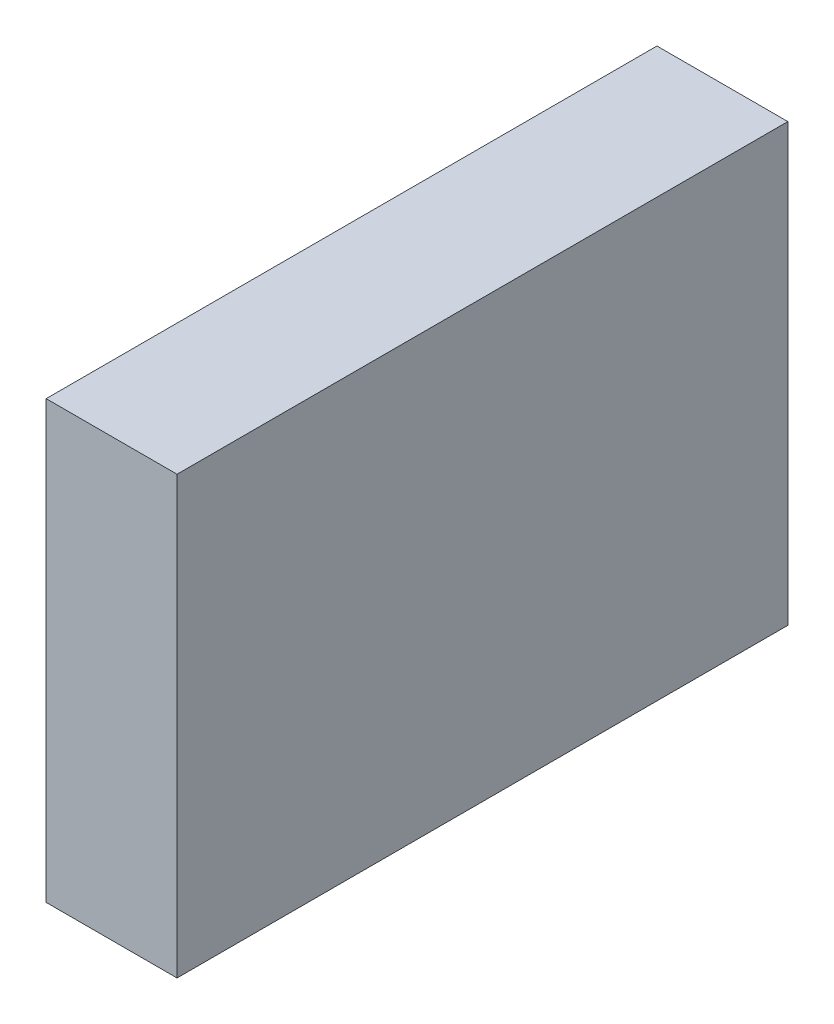
ISO-10303-21;
HEADER;
FILE_DESCRIPTION(('STEP AP214'),'2;1');
FILE_NAME('part.step','',(''),(''),'','','');
FILE_SCHEMA(('AUTOMOTIVE_DESIGN { 1 0 10303 214 1 1 1 1 }'));
ENDSEC;
DATA;
#1=APPLICATION_CONTEXT('core data for automotive mechanical design processes');
#2=APPLICATION_PROTOCOL_DEFINITION('international standard','automotive_design',2000,#1);
#3=PRODUCT_CONTEXT('',#1,'mechanical');
#4=PRODUCT('Part','Part','',(#3));
#5=PRODUCT_RELATED_PRODUCT_CATEGORY('part','',(#4));
#6=PRODUCT_DEFINITION_FORMATION('','',#4);
#7=PRODUCT_DEFINITION_CONTEXT('part definition',#1,'design');
#8=PRODUCT_DEFINITION('design','',#6,#7);
#9=PRODUCT_DEFINITION_SHAPE('','',#8);
#10=(LENGTH_UNIT() NAMED_UNIT(*) SI_UNIT(.MILLI.,.METRE.));
#11=(NAMED_UNIT(*) PLANE_ANGLE_UNIT() SI_UNIT($,.RADIAN.));
#12=(NAMED_UNIT(*) SI_UNIT($,.STERADIAN.) SOLID_ANGLE_UNIT());
#13=UNCERTAINTY_MEASURE_WITH_UNIT(LENGTH_MEASURE(1.E-05),#10,'distance_accuracy_value','');
#14=(GEOMETRIC_REPRESENTATION_CONTEXT(3) GLOBAL_UNCERTAINTY_ASSIGNED_CONTEXT((#13)) GLOBAL_UNIT_ASSIGNED_CONTEXT((#10,
#11,#12)) REPRESENTATION_CONTEXT('',''));
#15=CARTESIAN_POINT('',(0.,0.,0.));
#16=DIRECTION('',(0.,0.,1.));
#17=DIRECTION('',(1.,0.,0.));
#18=AXIS2_PLACEMENT_3D('',#15,#16,#17);
#19=CARTESIAN_POINT('',(3.90000011889499,0.679999495569579,-3.72112158044355));
#20=DIRECTION('',(1.,-1.74845553146952E-07,0.));
#21=DIRECTION('',(1.74845553146952E-07,1.,-8.74227765734759E-08));
#22=AXIS2_PLACEMENT_3D('',#19,#20,#21);
#23=PLANE('',#22);
#24=DIRECTION('',(0.,8.74227766369169E-08,0.999999999999996));
#25=VECTOR('',#24,1.);
#26=CARTESIAN_POINT('',(3.90000030597973,1.74999950169017,-3.65112167398592));
#27=LINE('',#26,#25);
#28=CARTESIAN_POINT('',(3.90000030597973,1.74999950169017,-3.65112167398492));
#29=VERTEX_POINT('',#28);
#30=CARTESIAN_POINT('',(3.90000030597974,1.74999962408106,-2.25112167398592));
#31=VERTEX_POINT('',#30);
#32=EDGE_CURVE('E11',#29,#31,#27,.T.);
#33=ORIENTED_EDGE('',*,*,#32,.F.);
#34=DIRECTION('',(1.74845553146599E-07,0.999999999999981,-8.74227765732994E-08));
#35=VECTOR('',#34,1.);
#36=CARTESIAN_POINT('',(3.90000013113418,0.749999501688174,-3.65112158656315));
#37=LINE('',#36,#35);
#38=CARTESIAN_POINT('',(3.90000013113418,0.749999501689174,-3.65112158656315));
#39=VERTEX_POINT('',#38);
#40=EDGE_CURVE('E59',#39,#29,#37,.T.);
#41=ORIENTED_EDGE('',*,*,#40,.F.);
#42=DIRECTION('',(0.,-8.74227765576152E-08,-0.999999999999996));
#43=VECTOR('',#42,1.);
#44=CARTESIAN_POINT('',(3.90000013113419,0.749999624080061,-2.25112158656315));
#45=LINE('',#44,#43);
#46=CARTESIAN_POINT('',(3.90000013113419,0.749999624080061,-2.25112158656415));
#47=VERTEX_POINT('',#46);
#48=EDGE_CURVE('E79',#47,#39,#45,.T.);
#49=ORIENTED_EDGE('',*,*,#48,.F.);
#50=DIRECTION('',(-1.74845553146599E-07,-0.999999999999981,8.74227765732993E-08));
#51=VECTOR('',#50,1.);
#52=CARTESIAN_POINT('',(3.90000030597974,1.74999962408206,-2.25112167398592));
#53=LINE('',#52,#51);
#54=EDGE_CURVE('E84',#31,#47,#53,.T.);
#55=ORIENTED_EDGE('',*,*,#54,.F.);
#56=EDGE_LOOP('',(#33,#41,#49,#55));
#57=FACE_BOUND('',#56,.T.);
#58=ADVANCED_FACE('F17',(#57),#23,.F.);
#59=CARTESIAN_POINT('',(4.20000011889499,0.679999443115913,-3.72112158044355));
#60=DIRECTION('',(1.,-1.74845553146952E-07,0.));
#61=DIRECTION('',(1.74845553146952E-07,1.,-8.74227765734759E-08));
#62=AXIS2_PLACEMENT_3D('',#59,#60,#61);
#63=PLANE('',#62);
#64=DIRECTION('',(-1.74845553146599E-07,-0.999999999999981,8.74227761292101E-08));
#65=VECTOR('',#64,1.);
#66=CARTESIAN_POINT('',(4.20000030597974,1.7499995716284,-2.25112167398592));
#67=LINE('',#66,#65);
#68=CARTESIAN_POINT('',(4.20000030597974,1.74999957162739,-2.25112167398592));
#69=VERTEX_POINT('',#68);
#70=CARTESIAN_POINT('',(4.20000013113419,0.749999571626395,-2.25112158656414));
#71=VERTEX_POINT('',#70);
#72=EDGE_CURVE('E24',#69,#71,#67,.T.);
#73=ORIENTED_EDGE('',*,*,#72,.T.);
#74=DIRECTION('',(0.,-8.74227765576152E-08,-0.999999999999996));
#75=VECTOR('',#74,1.);
#76=CARTESIAN_POINT('',(4.20000013113419,0.749999571626395,-2.25112158656314));
#77=LINE('',#76,#75);
#78=CARTESIAN_POINT('',(4.20000013113418,0.749999449235508,-3.65112158656314));
#79=VERTEX_POINT('',#78);
#80=EDGE_CURVE('E82',#71,#79,#77,.T.);
#81=ORIENTED_EDGE('',*,*,#80,.T.);
#82=DIRECTION('',(1.74845553146599E-07,0.999999999999981,-8.74227765732994E-08));
#83=VECTOR('',#82,1.);
#84=CARTESIAN_POINT('',(4.20000013113418,0.749999449234508,-3.65112158656314));
#85=LINE('',#84,#83);
#86=CARTESIAN_POINT('',(4.20000030597973,1.74999944923651,-3.65112167398492));
#87=VERTEX_POINT('',#86);
#88=EDGE_CURVE('E64',#79,#87,#85,.T.);
#89=ORIENTED_EDGE('',*,*,#88,.T.);
#90=DIRECTION('',(0.,8.74227764783136E-08,0.999999999999996));
#91=VECTOR('',#90,1.);
#92=CARTESIAN_POINT('',(4.20000030597973,1.74999944923651,-3.65112167398592));
#93=LINE('',#92,#91);
#94=EDGE_CURVE('E61',#87,#69,#93,.T.);
#95=ORIENTED_EDGE('',*,*,#94,.T.);
#96=EDGE_LOOP('',(#73,#81,#89,#95));
#97=FACE_BOUND('',#96,.T.);
#98=ADVANCED_FACE('F62',(#97),#63,.T.);
#99=CARTESIAN_POINT('',(3.90000030597974,1.74999962408206,-2.25112167398592));
#100=DIRECTION('',(0.,8.74227765734759E-08,1.));
#101=DIRECTION('',(-1.74845553146952E-07,-1.,8.74227765734759E-08));
#102=AXIS2_PLACEMENT_3D('',#99,#100,#101);
#103=PLANE('',#102);
#104=ORIENTED_EDGE('',*,*,#54,.T.);
#105=DIRECTION('',(0.999999999999985,-1.74845553220963E-07,0.));
#106=VECTOR('',#105,1.);
#107=CARTESIAN_POINT('',(3.90000013113419,0.749999624080061,-2.25112158656315));
#108=LINE('',#107,#106);
#109=EDGE_CURVE('E57',#47,#71,#108,.T.);
#110=ORIENTED_EDGE('',*,*,#109,.T.);
#111=ORIENTED_EDGE('',*,*,#72,.F.);
#112=DIRECTION('',(0.999999999999985,-1.74845552850889E-07,0.));
#113=VECTOR('',#112,1.);
#114=CARTESIAN_POINT('',(3.90000030597974,1.74999962408206,-2.25112167398592));
#115=LINE('',#114,#113);
#116=EDGE_CURVE('E55',#31,#69,#115,.T.);
#117=ORIENTED_EDGE('',*,*,#116,.F.);
#118=EDGE_LOOP('',(#104,#110,#111,#117));
#119=FACE_BOUND('',#118,.T.);
#120=ADVANCED_FACE('F53',(#119),#103,.T.);
#121=CARTESIAN_POINT('',(3.90000013113419,0.749999624080061,-2.25112158656315));
#122=DIRECTION('',(-1.74845553146952E-07,-1.,8.74227765734759E-08));
#123=DIRECTION('',(0.,-8.74227765734759E-08,-1.));
#124=AXIS2_PLACEMENT_3D('',#121,#122,#123);
#125=PLANE('',#124);
#126=ORIENTED_EDGE('',*,*,#48,.T.);
#127=DIRECTION('',(0.999999999999985,-1.74845553220963E-07,0.));
#128=VECTOR('',#127,1.);
#129=CARTESIAN_POINT('',(3.90000013113418,0.749999501688174,-3.65112158656315));
#130=LINE('',#129,#128);
#131=EDGE_CURVE('E68',#39,#79,#130,.T.);
#132=ORIENTED_EDGE('',*,*,#131,.T.);
#133=ORIENTED_EDGE('',*,*,#80,.F.);
#134=ORIENTED_EDGE('',*,*,#109,.F.);
#135=EDGE_LOOP('',(#126,#132,#133,#134));
#136=FACE_BOUND('',#135,.T.);
#137=ADVANCED_FACE('F91',(#136),#125,.T.);
#138=CARTESIAN_POINT('',(3.90000013113418,0.749999501688174,-3.65112158656315));
#139=DIRECTION('',(0.,-8.74227765734759E-08,-1.));
#140=DIRECTION('',(1.74845553146952E-07,1.,-8.74227765734759E-08));
#141=AXIS2_PLACEMENT_3D('',#138,#139,#140);
#142=PLANE('',#141);
#143=ORIENTED_EDGE('',*,*,#40,.T.);
#144=DIRECTION('',(0.999999999999985,-1.74845552850889E-07,0.));
#145=VECTOR('',#144,1.);
#146=CARTESIAN_POINT('',(3.90000030597973,1.74999950169017,-3.65112167398592));
#147=LINE('',#146,#145);
#148=EDGE_CURVE('E69',#29,#87,#147,.T.);
#149=ORIENTED_EDGE('',*,*,#148,.T.);
#150=ORIENTED_EDGE('',*,*,#88,.F.);
#151=ORIENTED_EDGE('',*,*,#131,.F.);
#152=EDGE_LOOP('',(#143,#149,#150,#151));
#153=FACE_BOUND('',#152,.T.);
#154=ADVANCED_FACE('F88',(#153),#142,.T.);
#155=CARTESIAN_POINT('',(3.90000030597973,1.74999950169017,-3.65112167398592));
#156=DIRECTION('',(1.74845553146952E-07,1.,-8.74227765734759E-08));
#157=DIRECTION('',(0.,8.74227765734759E-08,1.));
#158=AXIS2_PLACEMENT_3D('',#155,#156,#157);
#159=PLANE('',#158);
#160=ORIENTED_EDGE('',*,*,#32,.T.);
#161=ORIENTED_EDGE('',*,*,#116,.T.);
#162=ORIENTED_EDGE('',*,*,#94,.F.);
#163=ORIENTED_EDGE('',*,*,#148,.F.);
#164=EDGE_LOOP('',(#160,#161,#162,#163));
#165=FACE_BOUND('',#164,.T.);
#166=ADVANCED_FACE('F71',(#165),#159,.T.);
#167=CLOSED_SHELL('',(#58,#98,#120,#137,#154,#166));
#168=MANIFOLD_SOLID_BREP('B1',#167);
#169=ADVANCED_BREP_SHAPE_REPRESENTATION('',(#18,#168),#14);
#170=SHAPE_DEFINITION_REPRESENTATION(#9,#169);
ENDSEC;
END-ISO-10303-21;
